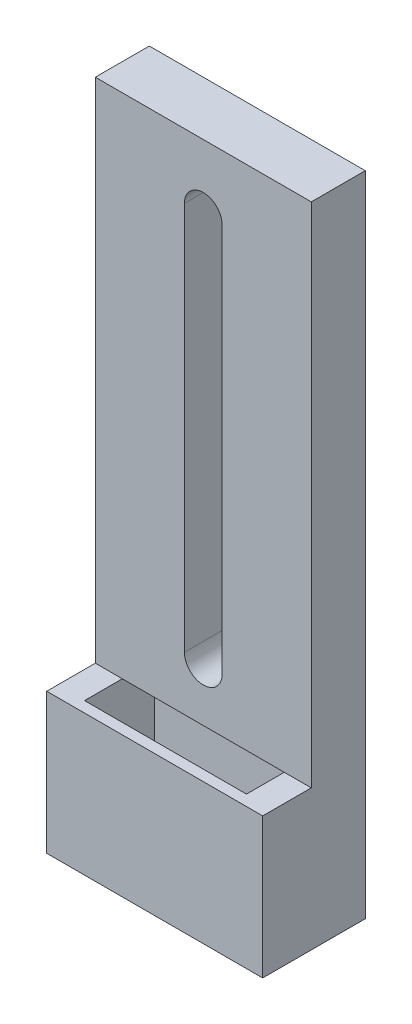
ISO-10303-21;
HEADER;
FILE_DESCRIPTION(('STEP AP214'),'2;1');
FILE_NAME('part.step','',(''),(''),'','','');
FILE_SCHEMA(('AUTOMOTIVE_DESIGN { 1 0 10303 214 1 1 1 1 }'));
ENDSEC;
DATA;
#1=APPLICATION_CONTEXT('core data for automotive mechanical design processes');
#2=APPLICATION_PROTOCOL_DEFINITION('international standard','automotive_design',2000,#1);
#3=PRODUCT_CONTEXT('',#1,'mechanical');
#4=PRODUCT('Part','Part','',(#3));
#5=PRODUCT_RELATED_PRODUCT_CATEGORY('part','',(#4));
#6=PRODUCT_DEFINITION_FORMATION('','',#4);
#7=PRODUCT_DEFINITION_CONTEXT('part definition',#1,'design');
#8=PRODUCT_DEFINITION('design','',#6,#7);
#9=PRODUCT_DEFINITION_SHAPE('','',#8);
#10=(LENGTH_UNIT() NAMED_UNIT(*) SI_UNIT(.MILLI.,.METRE.));
#11=(NAMED_UNIT(*) PLANE_ANGLE_UNIT() SI_UNIT($,.RADIAN.));
#12=(NAMED_UNIT(*) SI_UNIT($,.STERADIAN.) SOLID_ANGLE_UNIT());
#13=UNCERTAINTY_MEASURE_WITH_UNIT(LENGTH_MEASURE(1.E-05),#10,'distance_accuracy_value','');
#14=(GEOMETRIC_REPRESENTATION_CONTEXT(3) GLOBAL_UNCERTAINTY_ASSIGNED_CONTEXT((#13)) GLOBAL_UNIT_ASSIGNED_CONTEXT((#10,
#11,#12)) REPRESENTATION_CONTEXT('',''));
#15=CARTESIAN_POINT('',(0.,0.,0.));
#16=DIRECTION('',(0.,0.,1.));
#17=DIRECTION('',(1.,0.,0.));
#18=AXIS2_PLACEMENT_3D('',#15,#16,#17);
#19=CARTESIAN_POINT('',(0.,0.,5.));
#20=DIRECTION('',(0.,1.,0.));
#21=DIRECTION('',(-1.,0.,0.));
#22=AXIS2_PLACEMENT_3D('',#19,#20,#21);
#23=PLANE('',#22);
#24=DIRECTION('',(0.,0.,-1.));
#25=VECTOR('',#24,1.);
#26=CARTESIAN_POINT('',(17.5,0.,2.));
#27=LINE('',#26,#25);
#28=CARTESIAN_POINT('',(17.5,0.,8.5));
#29=VERTEX_POINT('',#28);
#30=CARTESIAN_POINT('',(17.5,0.,2.));
#31=VERTEX_POINT('',#30);
#32=EDGE_CURVE('E177',#29,#31,#27,.T.);
#33=ORIENTED_EDGE('',*,*,#32,.T.);
#34=DIRECTION('',(-1.,0.,0.));
#35=VECTOR('',#34,1.);
#36=CARTESIAN_POINT('',(17.5,0.,2.));
#37=LINE('',#36,#35);
#38=CARTESIAN_POINT('',(2.5,0.,2.00000000000001));
#39=VERTEX_POINT('',#38);
#40=EDGE_CURVE('E167',#31,#39,#37,.T.);
#41=ORIENTED_EDGE('',*,*,#40,.T.);
#42=DIRECTION('',(0.,0.,1.));
#43=VECTOR('',#42,1.);
#44=CARTESIAN_POINT('',(2.5,0.,2.00000000000001));
#45=LINE('',#44,#43);
#46=CARTESIAN_POINT('',(2.5,0.,8.50000000000001));
#47=VERTEX_POINT('',#46);
#48=EDGE_CURVE('E170',#39,#47,#45,.T.);
#49=ORIENTED_EDGE('',*,*,#48,.T.);
#50=DIRECTION('',(1.,0.,0.));
#51=VECTOR('',#50,1.);
#52=CARTESIAN_POINT('',(17.5,0.,8.5));
#53=LINE('',#52,#51);
#54=EDGE_CURVE('E174',#47,#29,#53,.T.);
#55=ORIENTED_EDGE('',*,*,#54,.T.);
#56=EDGE_LOOP('',(#33,#41,#49,#55));
#57=FACE_BOUND('',#56,.T.);
#58=DIRECTION('',(1.,0.,0.));
#59=VECTOR('',#58,1.);
#60=CARTESIAN_POINT('',(0.,0.,0.));
#61=LINE('',#60,#59);
#62=CARTESIAN_POINT('',(0.,0.,0.));
#63=VERTEX_POINT('',#62);
#64=CARTESIAN_POINT('',(20.,0.,0.));
#65=VERTEX_POINT('',#64);
#66=EDGE_CURVE('E269',#63,#65,#61,.T.);
#67=ORIENTED_EDGE('',*,*,#66,.T.);
#68=DIRECTION('',(0.,0.,-1.));
#69=VECTOR('',#68,1.);
#70=CARTESIAN_POINT('',(20.,0.,5.));
#71=LINE('',#70,#69);
#72=CARTESIAN_POINT('',(20.,0.,9.5));
#73=VERTEX_POINT('',#72);
#74=EDGE_CURVE('E234',#73,#65,#71,.T.);
#75=ORIENTED_EDGE('',*,*,#74,.F.);
#76=DIRECTION('',(1.,0.,0.));
#77=VECTOR('',#76,1.);
#78=CARTESIAN_POINT('',(0.,0.,9.5));
#79=LINE('',#78,#77);
#80=CARTESIAN_POINT('',(0.,0.,9.5));
#81=VERTEX_POINT('',#80);
#82=EDGE_CURVE('E204',#81,#73,#79,.T.);
#83=ORIENTED_EDGE('',*,*,#82,.F.);
#84=DIRECTION('',(0.,0.,-1.));
#85=VECTOR('',#84,1.);
#86=CARTESIAN_POINT('',(0.,0.,5.));
#87=LINE('',#86,#85);
#88=EDGE_CURVE('E272',#81,#63,#87,.T.);
#89=ORIENTED_EDGE('',*,*,#88,.T.);
#90=EDGE_LOOP('',(#67,#75,#83,#89));
#91=FACE_BOUND('',#90,.T.);
#92=ADVANCED_FACE('F32',(#57,#91),#23,.F.);
#93=CARTESIAN_POINT('',(20.,0.,5.));
#94=DIRECTION('',(-1.,0.,0.));
#95=DIRECTION('',(0.,0.,1.));
#96=AXIS2_PLACEMENT_3D('',#93,#94,#95);
#97=PLANE('',#96);
#98=DIRECTION('',(0.,1.,0.));
#99=VECTOR('',#98,1.);
#100=CARTESIAN_POINT('',(20.,0.,0.));
#101=LINE('',#100,#99);
#102=CARTESIAN_POINT('',(20.,60.,0.));
#103=VERTEX_POINT('',#102);
#104=EDGE_CURVE('E274',#65,#103,#101,.T.);
#105=ORIENTED_EDGE('',*,*,#104,.T.);
#106=DIRECTION('',(0.,0.,-1.));
#107=VECTOR('',#106,1.);
#108=CARTESIAN_POINT('',(20.,60.,5.));
#109=LINE('',#108,#107);
#110=CARTESIAN_POINT('',(20.,60.,5.));
#111=VERTEX_POINT('',#110);
#112=EDGE_CURVE('E292',#111,#103,#109,.T.);
#113=ORIENTED_EDGE('',*,*,#112,.F.);
#114=DIRECTION('',(0.,1.,0.));
#115=VECTOR('',#114,1.);
#116=CARTESIAN_POINT('',(20.,0.,5.));
#117=LINE('',#116,#115);
#118=CARTESIAN_POINT('',(20.,13.,5.));
#119=VERTEX_POINT('',#118);
#120=EDGE_CURVE('E286',#119,#111,#117,.T.);
#121=ORIENTED_EDGE('',*,*,#120,.F.);
#122=DIRECTION('',(0.,0.,-1.));
#123=VECTOR('',#122,1.);
#124=CARTESIAN_POINT('',(20.,13.,9.5));
#125=LINE('',#124,#123);
#126=CARTESIAN_POINT('',(20.,13.,9.5));
#127=VERTEX_POINT('',#126);
#128=EDGE_CURVE('E275',#127,#119,#125,.T.);
#129=ORIENTED_EDGE('',*,*,#128,.F.);
#130=DIRECTION('',(0.,1.,0.));
#131=VECTOR('',#130,1.);
#132=CARTESIAN_POINT('',(20.,0.,9.5));
#133=LINE('',#132,#131);
#134=EDGE_CURVE('E208',#73,#127,#133,.T.);
#135=ORIENTED_EDGE('',*,*,#134,.F.);
#136=ORIENTED_EDGE('',*,*,#74,.T.);
#137=EDGE_LOOP('',(#105,#113,#121,#129,#135,#136));
#138=FACE_BOUND('',#137,.T.);
#139=ADVANCED_FACE('F257',(#138),#97,.F.);
#140=CARTESIAN_POINT('',(0.,60.,5.));
#141=DIRECTION('',(0.,-1.,0.));
#142=DIRECTION('',(0.,0.,-1.));
#143=AXIS2_PLACEMENT_3D('',#140,#141,#142);
#144=PLANE('',#143);
#145=DIRECTION('',(-1.,0.,0.));
#146=VECTOR('',#145,1.);
#147=CARTESIAN_POINT('',(0.,60.,0.));
#148=LINE('',#147,#146);
#149=CARTESIAN_POINT('',(0.,60.,0.));
#150=VERTEX_POINT('',#149);
#151=EDGE_CURVE('E277',#103,#150,#148,.T.);
#152=ORIENTED_EDGE('',*,*,#151,.T.);
#153=DIRECTION('',(0.,0.,-1.));
#154=VECTOR('',#153,1.);
#155=CARTESIAN_POINT('',(0.,60.,5.));
#156=LINE('',#155,#154);
#157=CARTESIAN_POINT('',(0.,60.,5.));
#158=VERTEX_POINT('',#157);
#159=EDGE_CURVE('E288',#158,#150,#156,.T.);
#160=ORIENTED_EDGE('',*,*,#159,.F.);
#161=DIRECTION('',(-1.,0.,0.));
#162=VECTOR('',#161,1.);
#163=CARTESIAN_POINT('',(0.,60.,5.));
#164=LINE('',#163,#162);
#165=EDGE_CURVE('E296',#111,#158,#164,.T.);
#166=ORIENTED_EDGE('',*,*,#165,.F.);
#167=ORIENTED_EDGE('',*,*,#112,.T.);
#168=EDGE_LOOP('',(#152,#160,#166,#167));
#169=FACE_BOUND('',#168,.T.);
#170=ADVANCED_FACE('F262',(#169),#144,.F.);
#171=CARTESIAN_POINT('',(0.,0.,5.));
#172=DIRECTION('',(1.,0.,0.));
#173=DIRECTION('',(0.,0.,-1.));
#174=AXIS2_PLACEMENT_3D('',#171,#172,#173);
#175=PLANE('',#174);
#176=DIRECTION('',(0.,-1.,0.));
#177=VECTOR('',#176,1.);
#178=CARTESIAN_POINT('',(0.,0.,0.));
#179=LINE('',#178,#177);
#180=EDGE_CURVE('E284',#150,#63,#179,.T.);
#181=ORIENTED_EDGE('',*,*,#180,.T.);
#182=ORIENTED_EDGE('',*,*,#88,.F.);
#183=DIRECTION('',(0.,-1.,0.));
#184=VECTOR('',#183,1.);
#185=CARTESIAN_POINT('',(0.,0.,9.5));
#186=LINE('',#185,#184);
#187=CARTESIAN_POINT('',(0.,13.,9.5));
#188=VERTEX_POINT('',#187);
#189=EDGE_CURVE('E201',#188,#81,#186,.T.);
#190=ORIENTED_EDGE('',*,*,#189,.F.);
#191=DIRECTION('',(0.,0.,-1.));
#192=VECTOR('',#191,1.);
#193=CARTESIAN_POINT('',(0.,13.,9.5));
#194=LINE('',#193,#192);
#195=CARTESIAN_POINT('',(0.,13.,5.));
#196=VERTEX_POINT('',#195);
#197=EDGE_CURVE('E212',#188,#196,#194,.T.);
#198=ORIENTED_EDGE('',*,*,#197,.T.);
#199=DIRECTION('',(0.,-1.,0.));
#200=VECTOR('',#199,1.);
#201=CARTESIAN_POINT('',(0.,0.,5.));
#202=LINE('',#201,#200);
#203=EDGE_CURVE('E289',#158,#196,#202,.T.);
#204=ORIENTED_EDGE('',*,*,#203,.F.);
#205=ORIENTED_EDGE('',*,*,#159,.T.);
#206=EDGE_LOOP('',(#181,#182,#190,#198,#204,#205));
#207=FACE_BOUND('',#206,.T.);
#208=ADVANCED_FACE('F308',(#207),#175,.F.);
#209=CARTESIAN_POINT('',(20.,0.,5.));
#210=DIRECTION('',(0.,0.,1.));
#211=DIRECTION('',(1.,0.,0.));
#212=AXIS2_PLACEMENT_3D('',#209,#210,#211);
#213=PLANE('',#212);
#214=CARTESIAN_POINT('',(10.,54.,5.));
#215=DIRECTION('',(0.,0.,1.));
#216=DIRECTION('',(1.,0.,0.));
#217=AXIS2_PLACEMENT_3D('',#214,#215,#216);
#218=CIRCLE('',#217,1.75);
#219=CARTESIAN_POINT('',(11.75,54.,5.));
#220=VERTEX_POINT('',#219);
#221=CARTESIAN_POINT('',(8.25,54.,5.));
#222=VERTEX_POINT('',#221);
#223=EDGE_CURVE('E46',#220,#222,#218,.T.);
#224=ORIENTED_EDGE('',*,*,#223,.F.);
#225=DIRECTION('',(0.,1.,0.));
#226=VECTOR('',#225,1.);
#227=CARTESIAN_POINT('',(11.75,54.,5.));
#228=LINE('',#227,#226);
#229=CARTESIAN_POINT('',(11.75,18.,5.));
#230=VERTEX_POINT('',#229);
#231=EDGE_CURVE('E157',#230,#220,#228,.T.);
#232=ORIENTED_EDGE('',*,*,#231,.F.);
#233=CARTESIAN_POINT('',(10.,18.,5.));
#234=DIRECTION('',(0.,0.,1.));
#235=DIRECTION('',(1.,0.,0.));
#236=AXIS2_PLACEMENT_3D('',#233,#234,#235);
#237=CIRCLE('',#236,1.75);
#238=CARTESIAN_POINT('',(8.25,18.,5.));
#239=VERTEX_POINT('',#238);
#240=EDGE_CURVE('E141',#239,#230,#237,.T.);
#241=ORIENTED_EDGE('',*,*,#240,.F.);
#242=DIRECTION('',(0.,-1.,0.));
#243=VECTOR('',#242,1.);
#244=CARTESIAN_POINT('',(8.25,54.,5.));
#245=LINE('',#244,#243);
#246=EDGE_CURVE('E150',#222,#239,#245,.T.);
#247=ORIENTED_EDGE('',*,*,#246,.F.);
#248=EDGE_LOOP('',(#224,#232,#241,#247));
#249=FACE_BOUND('',#248,.T.);
#250=DIRECTION('',(-1.,0.,0.));
#251=VECTOR('',#250,1.);
#252=CARTESIAN_POINT('',(0.,13.,5.));
#253=LINE('',#252,#251);
#254=CARTESIAN_POINT('',(17.5,13.,5.));
#255=VERTEX_POINT('',#254);
#256=EDGE_CURVE('E205',#119,#255,#253,.T.);
#257=ORIENTED_EDGE('',*,*,#256,.F.);
#258=ORIENTED_EDGE('',*,*,#120,.T.);
#259=ORIENTED_EDGE('',*,*,#165,.T.);
#260=ORIENTED_EDGE('',*,*,#203,.T.);
#261=CARTESIAN_POINT('',(2.5,13.,5.));
#262=VERTEX_POINT('',#261);
#263=EDGE_CURVE('E194',#262,#196,#253,.T.);
#264=ORIENTED_EDGE('',*,*,#263,.F.);
#265=EDGE_CURVE('E224',#255,#262,#253,.T.);
#266=ORIENTED_EDGE('',*,*,#265,.F.);
#267=EDGE_LOOP('',(#257,#258,#259,#260,#264,#266));
#268=FACE_BOUND('',#267,.T.);
#269=ADVANCED_FACE('F154',(#249,#268),#213,.T.);
#270=CARTESIAN_POINT('',(20.,0.,0.));
#271=DIRECTION('',(0.,0.,1.));
#272=DIRECTION('',(1.,0.,0.));
#273=AXIS2_PLACEMENT_3D('',#270,#271,#272);
#274=PLANE('',#273);
#275=DIRECTION('',(0.,1.,0.));
#276=VECTOR('',#275,1.);
#277=CARTESIAN_POINT('',(11.75,0.,0.));
#278=LINE('',#277,#276);
#279=CARTESIAN_POINT('',(11.75,18.,0.));
#280=VERTEX_POINT('',#279);
#281=CARTESIAN_POINT('',(11.75,54.,0.));
#282=VERTEX_POINT('',#281);
#283=EDGE_CURVE('E39',#280,#282,#278,.T.);
#284=ORIENTED_EDGE('',*,*,#283,.T.);
#285=CARTESIAN_POINT('',(10.,54.,0.));
#286=DIRECTION('',(0.,0.,1.));
#287=DIRECTION('',(1.,0.,0.));
#288=AXIS2_PLACEMENT_3D('',#285,#286,#287);
#289=CIRCLE('',#288,1.75);
#290=CARTESIAN_POINT('',(8.25,54.,0.));
#291=VERTEX_POINT('',#290);
#292=EDGE_CURVE('E11',#282,#291,#289,.T.);
#293=ORIENTED_EDGE('',*,*,#292,.T.);
#294=DIRECTION('',(0.,-1.,0.));
#295=VECTOR('',#294,1.);
#296=CARTESIAN_POINT('',(8.25000000000001,0.,0.));
#297=LINE('',#296,#295);
#298=CARTESIAN_POINT('',(8.25,18.,0.));
#299=VERTEX_POINT('',#298);
#300=EDGE_CURVE('E233',#291,#299,#297,.T.);
#301=ORIENTED_EDGE('',*,*,#300,.T.);
#302=CARTESIAN_POINT('',(10.,18.,0.));
#303=DIRECTION('',(0.,0.,1.));
#304=DIRECTION('',(1.,0.,0.));
#305=AXIS2_PLACEMENT_3D('',#302,#303,#304);
#306=CIRCLE('',#305,1.75);
#307=EDGE_CURVE('E144',#299,#280,#306,.T.);
#308=ORIENTED_EDGE('',*,*,#307,.T.);
#309=EDGE_LOOP('',(#284,#293,#301,#308));
#310=FACE_BOUND('',#309,.T.);
#311=ORIENTED_EDGE('',*,*,#66,.F.);
#312=ORIENTED_EDGE('',*,*,#180,.F.);
#313=ORIENTED_EDGE('',*,*,#151,.F.);
#314=ORIENTED_EDGE('',*,*,#104,.F.);
#315=EDGE_LOOP('',(#311,#312,#313,#314));
#316=FACE_BOUND('',#315,.T.);
#317=ADVANCED_FACE('F238',(#310,#316),#274,.F.);
#318=CARTESIAN_POINT('',(0.,13.,9.5));
#319=DIRECTION('',(0.,-1.,0.));
#320=DIRECTION('',(0.,0.,-1.));
#321=AXIS2_PLACEMENT_3D('',#318,#319,#320);
#322=PLANE('',#321);
#323=ORIENTED_EDGE('',*,*,#256,.T.);
#324=DIRECTION('',(0.,0.,-1.));
#325=VECTOR('',#324,1.);
#326=CARTESIAN_POINT('',(17.5,13.,2.));
#327=LINE('',#326,#325);
#328=CARTESIAN_POINT('',(17.5,13.,8.5));
#329=VERTEX_POINT('',#328);
#330=EDGE_CURVE('E171',#329,#255,#327,.T.);
#331=ORIENTED_EDGE('',*,*,#330,.F.);
#332=DIRECTION('',(1.,0.,0.));
#333=VECTOR('',#332,1.);
#334=CARTESIAN_POINT('',(17.5,13.,8.5));
#335=LINE('',#334,#333);
#336=CARTESIAN_POINT('',(2.5,13.,8.50000000000001));
#337=VERTEX_POINT('',#336);
#338=EDGE_CURVE('E185',#337,#329,#335,.T.);
#339=ORIENTED_EDGE('',*,*,#338,.F.);
#340=DIRECTION('',(0.,0.,-1.));
#341=VECTOR('',#340,1.);
#342=CARTESIAN_POINT('',(2.5,13.,9.5));
#343=LINE('',#342,#341);
#344=EDGE_CURVE('E230',#337,#262,#343,.T.);
#345=ORIENTED_EDGE('',*,*,#344,.T.);
#346=ORIENTED_EDGE('',*,*,#263,.T.);
#347=ORIENTED_EDGE('',*,*,#197,.F.);
#348=DIRECTION('',(-1.,0.,0.));
#349=VECTOR('',#348,1.);
#350=CARTESIAN_POINT('',(0.,13.,9.5));
#351=LINE('',#350,#349);
#352=EDGE_CURVE('E210',#127,#188,#351,.T.);
#353=ORIENTED_EDGE('',*,*,#352,.F.);
#354=ORIENTED_EDGE('',*,*,#128,.T.);
#355=EDGE_LOOP('',(#323,#331,#339,#345,#346,#347,#353,#354));
#356=FACE_BOUND('',#355,.T.);
#357=ADVANCED_FACE('F316',(#356),#322,.F.);
#358=CARTESIAN_POINT('',(0.,13.,9.5));
#359=DIRECTION('',(0.,0.,-1.));
#360=DIRECTION('',(-1.,0.,0.));
#361=AXIS2_PLACEMENT_3D('',#358,#359,#360);
#362=PLANE('',#361);
#363=ORIENTED_EDGE('',*,*,#189,.T.);
#364=ORIENTED_EDGE('',*,*,#82,.T.);
#365=ORIENTED_EDGE('',*,*,#134,.T.);
#366=ORIENTED_EDGE('',*,*,#352,.T.);
#367=EDGE_LOOP('',(#363,#364,#365,#366));
#368=FACE_BOUND('',#367,.T.);
#369=ADVANCED_FACE('F324',(#368),#362,.F.);
#370=CARTESIAN_POINT('',(17.5,0.,2.));
#371=DIRECTION('',(0.,0.,-1.));
#372=DIRECTION('',(-1.,0.,0.));
#373=AXIS2_PLACEMENT_3D('',#370,#371,#372);
#374=PLANE('',#373);
#375=DIRECTION('',(-1.,0.,0.));
#376=VECTOR('',#375,1.);
#377=CARTESIAN_POINT('',(17.5,13.,2.));
#378=LINE('',#377,#376);
#379=CARTESIAN_POINT('',(17.5,13.,2.));
#380=VERTEX_POINT('',#379);
#381=CARTESIAN_POINT('',(2.5,13.,2.00000000000001));
#382=VERTEX_POINT('',#381);
#383=EDGE_CURVE('E164',#380,#382,#378,.T.);
#384=ORIENTED_EDGE('',*,*,#383,.T.);
#385=DIRECTION('',(0.,1.,0.));
#386=VECTOR('',#385,1.);
#387=CARTESIAN_POINT('',(2.5,0.,2.00000000000001));
#388=LINE('',#387,#386);
#389=EDGE_CURVE('E180',#39,#382,#388,.T.);
#390=ORIENTED_EDGE('',*,*,#389,.F.);
#391=ORIENTED_EDGE('',*,*,#40,.F.);
#392=DIRECTION('',(0.,1.,0.));
#393=VECTOR('',#392,1.);
#394=CARTESIAN_POINT('',(17.5,0.,2.));
#395=LINE('',#394,#393);
#396=EDGE_CURVE('E191',#31,#380,#395,.T.);
#397=ORIENTED_EDGE('',*,*,#396,.T.);
#398=EDGE_LOOP('',(#384,#390,#391,#397));
#399=FACE_BOUND('',#398,.T.);
#400=ADVANCED_FACE('F326',(#399),#374,.F.);
#401=CARTESIAN_POINT('',(17.5,0.,2.));
#402=DIRECTION('',(1.,0.,0.));
#403=DIRECTION('',(0.,0.,-1.));
#404=AXIS2_PLACEMENT_3D('',#401,#402,#403);
#405=PLANE('',#404);
#406=ORIENTED_EDGE('',*,*,#330,.T.);
#407=EDGE_CURVE('E188',#255,#380,#327,.T.);
#408=ORIENTED_EDGE('',*,*,#407,.T.);
#409=ORIENTED_EDGE('',*,*,#396,.F.);
#410=ORIENTED_EDGE('',*,*,#32,.F.);
#411=DIRECTION('',(0.,1.,0.));
#412=VECTOR('',#411,1.);
#413=CARTESIAN_POINT('',(17.5,0.,8.5));
#414=LINE('',#413,#412);
#415=EDGE_CURVE('E195',#29,#329,#414,.T.);
#416=ORIENTED_EDGE('',*,*,#415,.T.);
#417=EDGE_LOOP('',(#406,#408,#409,#410,#416));
#418=FACE_BOUND('',#417,.T.);
#419=ADVANCED_FACE('F332',(#418),#405,.F.);
#420=CARTESIAN_POINT('',(17.5,0.,8.5));
#421=DIRECTION('',(0.,0.,1.));
#422=DIRECTION('',(1.,0.,0.));
#423=AXIS2_PLACEMENT_3D('',#420,#421,#422);
#424=PLANE('',#423);
#425=ORIENTED_EDGE('',*,*,#338,.T.);
#426=ORIENTED_EDGE('',*,*,#415,.F.);
#427=ORIENTED_EDGE('',*,*,#54,.F.);
#428=DIRECTION('',(0.,1.,0.));
#429=VECTOR('',#428,1.);
#430=CARTESIAN_POINT('',(2.5,0.,8.50000000000001));
#431=LINE('',#430,#429);
#432=EDGE_CURVE('E197',#47,#337,#431,.T.);
#433=ORIENTED_EDGE('',*,*,#432,.T.);
#434=EDGE_LOOP('',(#425,#426,#427,#433));
#435=FACE_BOUND('',#434,.T.);
#436=ADVANCED_FACE('F384',(#435),#424,.F.);
#437=CARTESIAN_POINT('',(2.5,0.,2.00000000000001));
#438=DIRECTION('',(-1.,0.,0.));
#439=DIRECTION('',(0.,0.,1.));
#440=AXIS2_PLACEMENT_3D('',#437,#438,#439);
#441=PLANE('',#440);
#442=DIRECTION('',(0.,0.,1.));
#443=VECTOR('',#442,1.);
#444=CARTESIAN_POINT('',(2.5,13.,2.00000000000001));
#445=LINE('',#444,#443);
#446=EDGE_CURVE('E183',#382,#262,#445,.T.);
#447=ORIENTED_EDGE('',*,*,#446,.T.);
#448=ORIENTED_EDGE('',*,*,#344,.F.);
#449=ORIENTED_EDGE('',*,*,#432,.F.);
#450=ORIENTED_EDGE('',*,*,#48,.F.);
#451=ORIENTED_EDGE('',*,*,#389,.T.);
#452=EDGE_LOOP('',(#447,#448,#449,#450,#451));
#453=FACE_BOUND('',#452,.T.);
#454=ADVANCED_FACE('F252',(#453),#441,.F.);
#455=CARTESIAN_POINT('',(2.5,13.,2.00000000000001));
#456=DIRECTION('',(0.,1.,0.));
#457=DIRECTION('',(0.,0.,1.));
#458=AXIS2_PLACEMENT_3D('',#455,#456,#457);
#459=PLANE('',#458);
#460=ORIENTED_EDGE('',*,*,#265,.T.);
#461=ORIENTED_EDGE('',*,*,#446,.F.);
#462=ORIENTED_EDGE('',*,*,#383,.F.);
#463=ORIENTED_EDGE('',*,*,#407,.F.);
#464=EDGE_LOOP('',(#460,#461,#462,#463));
#465=FACE_BOUND('',#464,.T.);
#466=ADVANCED_FACE('F245',(#465),#459,.F.);
#467=CARTESIAN_POINT('',(10.,54.,-5.));
#468=DIRECTION('',(0.,0.,1.));
#469=DIRECTION('',(1.,0.,0.));
#470=AXIS2_PLACEMENT_3D('',#467,#468,#469);
#471=CYLINDRICAL_SURFACE('',#470,1.75);
#472=DIRECTION('',(0.,0.,1.));
#473=VECTOR('',#472,1.);
#474=CARTESIAN_POINT('',(11.75,54.,-5.));
#475=LINE('',#474,#473);
#476=EDGE_CURVE('E162',#282,#220,#475,.T.);
#477=ORIENTED_EDGE('',*,*,#476,.T.);
#478=ORIENTED_EDGE('',*,*,#223,.T.);
#479=DIRECTION('',(0.,0.,1.));
#480=VECTOR('',#479,1.);
#481=CARTESIAN_POINT('',(8.25,54.,-5.));
#482=LINE('',#481,#480);
#483=EDGE_CURVE('E147',#291,#222,#482,.T.);
#484=ORIENTED_EDGE('',*,*,#483,.F.);
#485=ORIENTED_EDGE('',*,*,#292,.F.);
#486=EDGE_LOOP('',(#477,#478,#484,#485));
#487=FACE_BOUND('',#486,.T.);
#488=ADVANCED_FACE('F243',(#487),#471,.F.);
#489=CARTESIAN_POINT('',(11.75,54.,-5.));
#490=DIRECTION('',(1.,0.,0.));
#491=DIRECTION('',(0.,1.,0.));
#492=AXIS2_PLACEMENT_3D('',#489,#490,#491);
#493=PLANE('',#492);
#494=DIRECTION('',(0.,0.,1.));
#495=VECTOR('',#494,1.);
#496=CARTESIAN_POINT('',(11.75,18.,-5.));
#497=LINE('',#496,#495);
#498=EDGE_CURVE('E146',#280,#230,#497,.T.);
#499=ORIENTED_EDGE('',*,*,#498,.T.);
#500=ORIENTED_EDGE('',*,*,#231,.T.);
#501=ORIENTED_EDGE('',*,*,#476,.F.);
#502=ORIENTED_EDGE('',*,*,#283,.F.);
#503=EDGE_LOOP('',(#499,#500,#501,#502));
#504=FACE_BOUND('',#503,.T.);
#505=ADVANCED_FACE('F242',(#504),#493,.F.);
#506=CARTESIAN_POINT('',(10.,18.,-5.));
#507=DIRECTION('',(0.,0.,1.));
#508=DIRECTION('',(1.,0.,0.));
#509=AXIS2_PLACEMENT_3D('',#506,#507,#508);
#510=CYLINDRICAL_SURFACE('',#509,1.75);
#511=DIRECTION('',(0.,0.,1.));
#512=VECTOR('',#511,1.);
#513=CARTESIAN_POINT('',(8.25,18.,-5.));
#514=LINE('',#513,#512);
#515=EDGE_CURVE('E54',#299,#239,#514,.T.);
#516=ORIENTED_EDGE('',*,*,#515,.T.);
#517=ORIENTED_EDGE('',*,*,#240,.T.);
#518=ORIENTED_EDGE('',*,*,#498,.F.);
#519=ORIENTED_EDGE('',*,*,#307,.F.);
#520=EDGE_LOOP('',(#516,#517,#518,#519));
#521=FACE_BOUND('',#520,.T.);
#522=ADVANCED_FACE('F138',(#521),#510,.F.);
#523=CARTESIAN_POINT('',(8.25,54.,-5.));
#524=DIRECTION('',(-1.,0.,0.));
#525=DIRECTION('',(0.,-1.,0.));
#526=AXIS2_PLACEMENT_3D('',#523,#524,#525);
#527=PLANE('',#526);
#528=ORIENTED_EDGE('',*,*,#483,.T.);
#529=ORIENTED_EDGE('',*,*,#246,.T.);
#530=ORIENTED_EDGE('',*,*,#515,.F.);
#531=ORIENTED_EDGE('',*,*,#300,.F.);
#532=EDGE_LOOP('',(#528,#529,#530,#531));
#533=FACE_BOUND('',#532,.T.);
#534=ADVANCED_FACE('F151',(#533),#527,.F.);
#535=CLOSED_SHELL('',(#92,#139,#170,#208,#269,#317,#357,#369,#400,#419,#436,#454,#466,#488,#505,
#522,#534));
#536=MANIFOLD_SOLID_BREP('B2',#535);
#537=ADVANCED_BREP_SHAPE_REPRESENTATION('',(#18,#536),#14);
#538=SHAPE_DEFINITION_REPRESENTATION(#9,#537);
ENDSEC;
END-ISO-10303-21;
